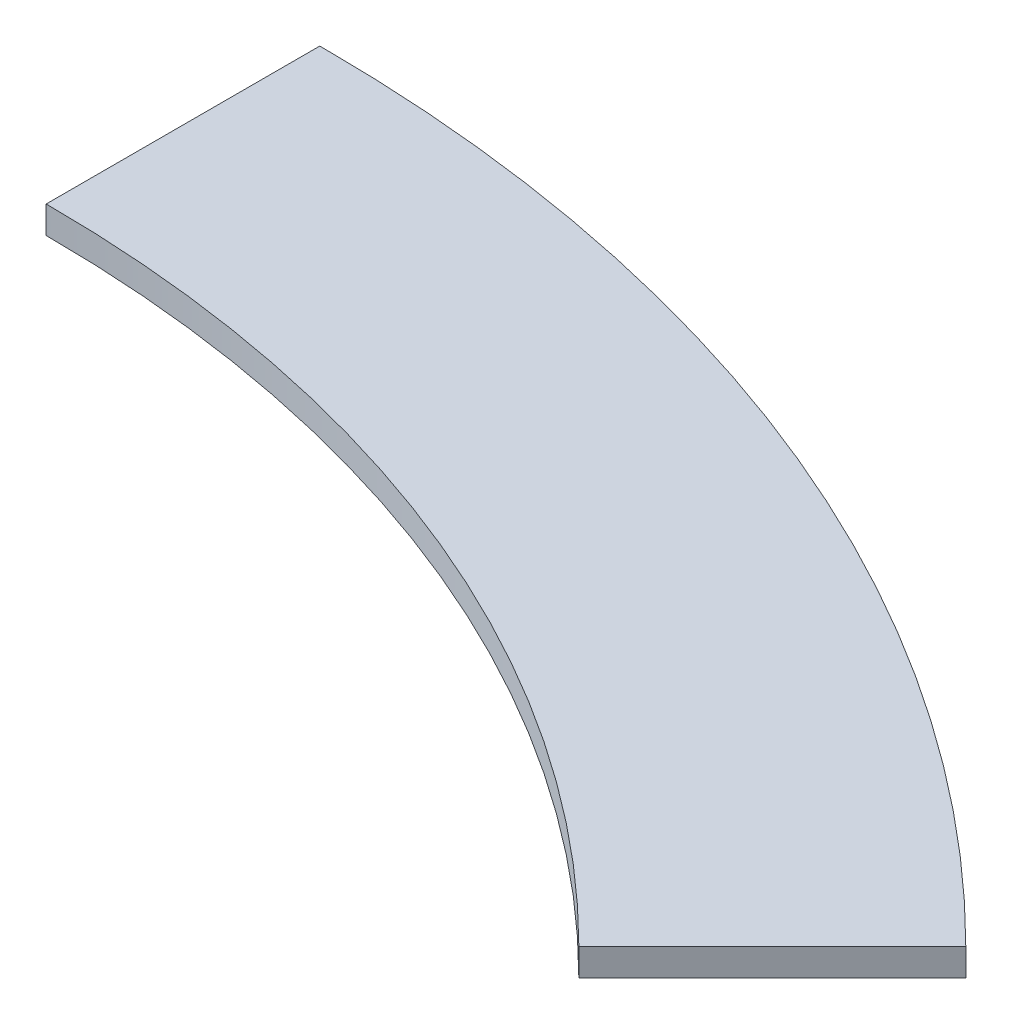
ISO-10303-21;
HEADER;
FILE_DESCRIPTION(('STEP AP214'),'2;1');
FILE_NAME('part.step','',(''),(''),'','','');
FILE_SCHEMA(('AUTOMOTIVE_DESIGN { 1 0 10303 214 1 1 1 1 }'));
ENDSEC;
DATA;
#1=APPLICATION_CONTEXT('core data for automotive mechanical design processes');
#2=APPLICATION_PROTOCOL_DEFINITION('international standard','automotive_design',2000,#1);
#3=PRODUCT_CONTEXT('',#1,'mechanical');
#4=PRODUCT('Part','Part','',(#3));
#5=PRODUCT_RELATED_PRODUCT_CATEGORY('part','',(#4));
#6=PRODUCT_DEFINITION_FORMATION('','',#4);
#7=PRODUCT_DEFINITION_CONTEXT('part definition',#1,'design');
#8=PRODUCT_DEFINITION('design','',#6,#7);
#9=PRODUCT_DEFINITION_SHAPE('','',#8);
#10=(LENGTH_UNIT() NAMED_UNIT(*) SI_UNIT(.MILLI.,.METRE.));
#11=(NAMED_UNIT(*) PLANE_ANGLE_UNIT() SI_UNIT($,.RADIAN.));
#12=(NAMED_UNIT(*) SI_UNIT($,.STERADIAN.) SOLID_ANGLE_UNIT());
#13=UNCERTAINTY_MEASURE_WITH_UNIT(LENGTH_MEASURE(1.E-05),#10,'distance_accuracy_value','');
#14=(GEOMETRIC_REPRESENTATION_CONTEXT(3) GLOBAL_UNCERTAINTY_ASSIGNED_CONTEXT((#13)) GLOBAL_UNIT_ASSIGNED_CONTEXT((#10,
#11,#12)) REPRESENTATION_CONTEXT('',''));
#15=CARTESIAN_POINT('',(0.,0.,0.));
#16=DIRECTION('',(0.,0.,1.));
#17=DIRECTION('',(1.,0.,0.));
#18=AXIS2_PLACEMENT_3D('',#15,#16,#17);
#19=CARTESIAN_POINT('',(0.,10.,0.));
#20=DIRECTION('',(0.,-1.,0.));
#21=DIRECTION('',(0.,0.,-1.));
#22=AXIS2_PLACEMENT_3D('',#19,#20,#21);
#23=CYLINDRICAL_SURFACE('',#22,570.);
#24=CARTESIAN_POINT('',(0.,0.,0.));
#25=DIRECTION('',(0.,1.,0.));
#26=DIRECTION('',(0.,0.,1.));
#27=AXIS2_PLACEMENT_3D('',#24,#25,#26);
#28=CIRCLE('',#27,570.);
#29=CARTESIAN_POINT('',(0.,0.,-570.));
#30=VERTEX_POINT('',#29);
#31=CARTESIAN_POINT('',(403.050865276333,0.,-403.050865276331));
#32=VERTEX_POINT('',#31);
#33=EDGE_CURVE('E99',#30,#32,#28,.F.);
#34=ORIENTED_EDGE('',*,*,#33,.F.);
#35=DIRECTION('',(0.,-1.,0.));
#36=VECTOR('',#35,1.);
#37=CARTESIAN_POINT('',(0.,10.,-570.));
#38=LINE('',#37,#36);
#39=CARTESIAN_POINT('',(0.,10.,-570.));
#40=VERTEX_POINT('',#39);
#41=EDGE_CURVE('E11',#40,#30,#38,.T.);
#42=ORIENTED_EDGE('',*,*,#41,.F.);
#43=CARTESIAN_POINT('',(0.,10.,0.));
#44=DIRECTION('',(0.,1.,0.));
#45=DIRECTION('',(0.,0.,1.));
#46=AXIS2_PLACEMENT_3D('',#43,#44,#45);
#47=CIRCLE('',#46,570.);
#48=CARTESIAN_POINT('',(403.050865276333,10.,-403.050865276331));
#49=VERTEX_POINT('',#48);
#50=EDGE_CURVE('E93',#40,#49,#47,.F.);
#51=ORIENTED_EDGE('',*,*,#50,.T.);
#52=DIRECTION('',(0.,-1.,0.));
#53=VECTOR('',#52,1.);
#54=CARTESIAN_POINT('',(403.050865276333,10.,-403.050865276331));
#55=LINE('',#54,#53);
#56=EDGE_CURVE('E74',#49,#32,#55,.T.);
#57=ORIENTED_EDGE('',*,*,#56,.T.);
#58=EDGE_LOOP('',(#34,#42,#51,#57));
#59=FACE_BOUND('',#58,.T.);
#60=ADVANCED_FACE('F36',(#59),#23,.T.);
#61=CARTESIAN_POINT('',(0.,10.,0.));
#62=DIRECTION('',(-1.,0.,0.));
#63=DIRECTION('',(0.,0.,1.));
#64=AXIS2_PLACEMENT_3D('',#61,#62,#63);
#65=PLANE('',#64);
#66=DIRECTION('',(0.,0.,-1.));
#67=VECTOR('',#66,1.);
#68=CARTESIAN_POINT('',(0.,0.,0.));
#69=LINE('',#68,#67);
#70=CARTESIAN_POINT('',(0.,0.,-470.));
#71=VERTEX_POINT('',#70);
#72=EDGE_CURVE('E87',#71,#30,#69,.T.);
#73=ORIENTED_EDGE('',*,*,#72,.F.);
#74=DIRECTION('',(0.,-1.,0.));
#75=VECTOR('',#74,1.);
#76=CARTESIAN_POINT('',(0.,10.,-470.));
#77=LINE('',#76,#75);
#78=CARTESIAN_POINT('',(0.,10.,-470.));
#79=VERTEX_POINT('',#78);
#80=EDGE_CURVE('E44',#79,#71,#77,.T.);
#81=ORIENTED_EDGE('',*,*,#80,.F.);
#82=DIRECTION('',(0.,0.,-1.));
#83=VECTOR('',#82,1.);
#84=CARTESIAN_POINT('',(0.,10.,0.));
#85=LINE('',#84,#83);
#86=EDGE_CURVE('E85',#79,#40,#85,.T.);
#87=ORIENTED_EDGE('',*,*,#86,.T.);
#88=ORIENTED_EDGE('',*,*,#41,.T.);
#89=EDGE_LOOP('',(#73,#81,#87,#88));
#90=FACE_BOUND('',#89,.T.);
#91=ADVANCED_FACE('F83',(#90),#65,.T.);
#92=CARTESIAN_POINT('',(0.,10.,0.));
#93=DIRECTION('',(0.,-1.,0.));
#94=DIRECTION('',(0.,0.,-1.));
#95=AXIS2_PLACEMENT_3D('',#92,#93,#94);
#96=CYLINDRICAL_SURFACE('',#95,470.);
#97=CARTESIAN_POINT('',(0.,0.,0.));
#98=DIRECTION('',(0.,1.,0.));
#99=DIRECTION('',(0.,0.,1.));
#100=AXIS2_PLACEMENT_3D('',#97,#98,#99);
#101=CIRCLE('',#100,470.);
#102=CARTESIAN_POINT('',(332.340187157678,0.,-332.340187157677));
#103=VERTEX_POINT('',#102);
#104=EDGE_CURVE('E67',#71,#103,#101,.F.);
#105=ORIENTED_EDGE('',*,*,#104,.T.);
#106=DIRECTION('',(0.,-1.,0.));
#107=VECTOR('',#106,1.);
#108=CARTESIAN_POINT('',(332.340187157678,10.,-332.340187157677));
#109=LINE('',#108,#107);
#110=CARTESIAN_POINT('',(332.340187157678,10.,-332.340187157677));
#111=VERTEX_POINT('',#110);
#112=EDGE_CURVE('E88',#111,#103,#109,.T.);
#113=ORIENTED_EDGE('',*,*,#112,.F.);
#114=CARTESIAN_POINT('',(0.,10.,0.));
#115=DIRECTION('',(0.,1.,0.));
#116=DIRECTION('',(0.,0.,1.));
#117=AXIS2_PLACEMENT_3D('',#114,#115,#116);
#118=CIRCLE('',#117,470.);
#119=EDGE_CURVE('E89',#79,#111,#118,.F.);
#120=ORIENTED_EDGE('',*,*,#119,.F.);
#121=ORIENTED_EDGE('',*,*,#80,.T.);
#122=EDGE_LOOP('',(#105,#113,#120,#121));
#123=FACE_BOUND('',#122,.T.);
#124=ADVANCED_FACE('F90',(#123),#96,.F.);
#125=CARTESIAN_POINT('',(0.,10.,0.));
#126=DIRECTION('',(-0.707106781186546,0.,-0.707106781186549));
#127=DIRECTION('',(-0.707106781186549,0.,0.707106781186546));
#128=AXIS2_PLACEMENT_3D('',#125,#126,#127);
#129=PLANE('',#128);
#130=DIRECTION('',(0.707106781186549,0.,-0.707106781186546));
#131=VECTOR('',#130,1.);
#132=CARTESIAN_POINT('',(0.,0.,0.));
#133=LINE('',#132,#131);
#134=EDGE_CURVE('E95',#103,#32,#133,.T.);
#135=ORIENTED_EDGE('',*,*,#134,.T.);
#136=ORIENTED_EDGE('',*,*,#56,.F.);
#137=DIRECTION('',(0.707106781186549,0.,-0.707106781186546));
#138=VECTOR('',#137,1.);
#139=CARTESIAN_POINT('',(0.,10.,0.));
#140=LINE('',#139,#138);
#141=EDGE_CURVE('E52',#111,#49,#140,.T.);
#142=ORIENTED_EDGE('',*,*,#141,.F.);
#143=ORIENTED_EDGE('',*,*,#112,.T.);
#144=EDGE_LOOP('',(#135,#136,#142,#143));
#145=FACE_BOUND('',#144,.T.);
#146=ADVANCED_FACE('F108',(#145),#129,.F.);
#147=CARTESIAN_POINT('',(0.,10.,0.));
#148=DIRECTION('',(0.,1.,0.));
#149=DIRECTION('',(0.,0.,1.));
#150=AXIS2_PLACEMENT_3D('',#147,#148,#149);
#151=PLANE('',#150);
#152=ORIENTED_EDGE('',*,*,#50,.F.);
#153=ORIENTED_EDGE('',*,*,#86,.F.);
#154=ORIENTED_EDGE('',*,*,#119,.T.);
#155=ORIENTED_EDGE('',*,*,#141,.T.);
#156=EDGE_LOOP('',(#152,#153,#154,#155));
#157=FACE_BOUND('',#156,.T.);
#158=ADVANCED_FACE('F92',(#157),#151,.T.);
#159=CARTESIAN_POINT('',(0.,0.,0.));
#160=DIRECTION('',(0.,1.,0.));
#161=DIRECTION('',(0.,0.,1.));
#162=AXIS2_PLACEMENT_3D('',#159,#160,#161);
#163=PLANE('',#162);
#164=ORIENTED_EDGE('',*,*,#33,.T.);
#165=ORIENTED_EDGE('',*,*,#134,.F.);
#166=ORIENTED_EDGE('',*,*,#104,.F.);
#167=ORIENTED_EDGE('',*,*,#72,.T.);
#168=EDGE_LOOP('',(#164,#165,#166,#167));
#169=FACE_BOUND('',#168,.T.);
#170=ADVANCED_FACE('F110',(#169),#163,.F.);
#171=CLOSED_SHELL('',(#60,#91,#124,#146,#158,#170));
#172=MANIFOLD_SOLID_BREP('B2',#171);
#173=ADVANCED_BREP_SHAPE_REPRESENTATION('',(#18,#172),#14);
#174=SHAPE_DEFINITION_REPRESENTATION(#9,#173);
ENDSEC;
END-ISO-10303-21;
